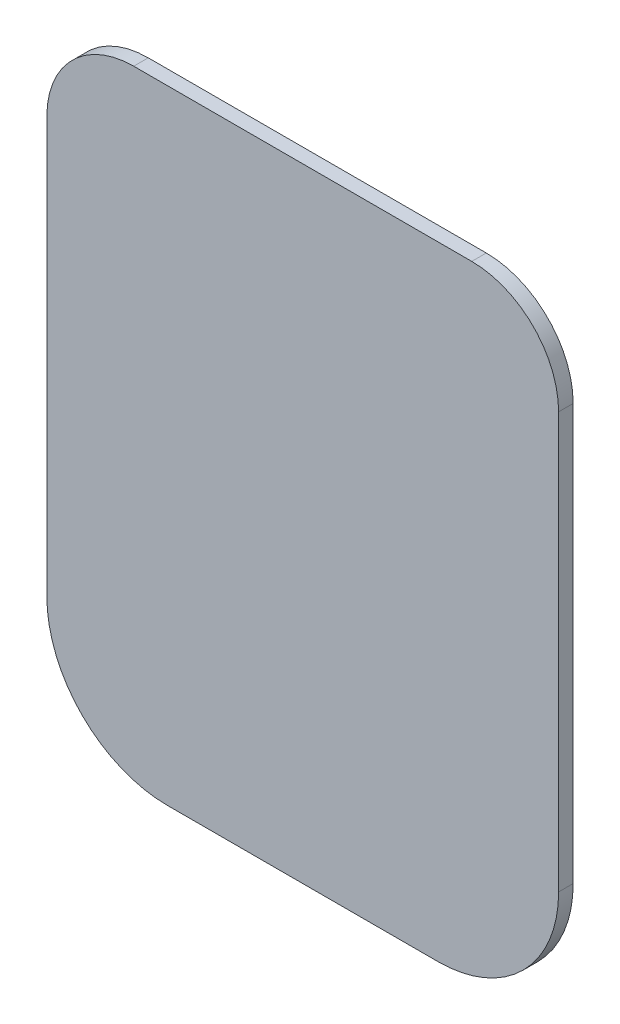
ISO-10303-21;
HEADER;
FILE_DESCRIPTION(('STEP AP214'),'2;1');
FILE_NAME('part.step','',(''),(''),'','','');
FILE_SCHEMA(('AUTOMOTIVE_DESIGN { 1 0 10303 214 1 1 1 1 }'));
ENDSEC;
DATA;
#1=APPLICATION_CONTEXT('core data for automotive mechanical design processes');
#2=APPLICATION_PROTOCOL_DEFINITION('international standard','automotive_design',2000,#1);
#3=PRODUCT_CONTEXT('',#1,'mechanical');
#4=PRODUCT('Part','Part','',(#3));
#5=PRODUCT_RELATED_PRODUCT_CATEGORY('part','',(#4));
#6=PRODUCT_DEFINITION_FORMATION('','',#4);
#7=PRODUCT_DEFINITION_CONTEXT('part definition',#1,'design');
#8=PRODUCT_DEFINITION('design','',#6,#7);
#9=PRODUCT_DEFINITION_SHAPE('','',#8);
#10=(LENGTH_UNIT() NAMED_UNIT(*) SI_UNIT(.MILLI.,.METRE.));
#11=(NAMED_UNIT(*) PLANE_ANGLE_UNIT() SI_UNIT($,.RADIAN.));
#12=(NAMED_UNIT(*) SI_UNIT($,.STERADIAN.) SOLID_ANGLE_UNIT());
#13=UNCERTAINTY_MEASURE_WITH_UNIT(LENGTH_MEASURE(1.E-05),#10,'distance_accuracy_value','');
#14=(GEOMETRIC_REPRESENTATION_CONTEXT(3) GLOBAL_UNCERTAINTY_ASSIGNED_CONTEXT((#13)) GLOBAL_UNIT_ASSIGNED_CONTEXT((#10,
#11,#12)) REPRESENTATION_CONTEXT('',''));
#15=CARTESIAN_POINT('',(0.,0.,0.));
#16=DIRECTION('',(0.,0.,1.));
#17=DIRECTION('',(1.,0.,0.));
#18=AXIS2_PLACEMENT_3D('',#15,#16,#17);
#19=CARTESIAN_POINT('',(40.,-56.5,4.29999999999997));
#20=DIRECTION('',(0.,0.,-1.));
#21=DIRECTION('',(-1.,0.,0.));
#22=AXIS2_PLACEMENT_3D('',#19,#20,#21);
#23=CYLINDRICAL_SURFACE('',#22,35.7);
#24=CARTESIAN_POINT('',(40.,-56.5,0.));
#25=DIRECTION('',(0.,0.,1.));
#26=DIRECTION('',(1.,0.,0.));
#27=AXIS2_PLACEMENT_3D('',#24,#25,#26);
#28=CIRCLE('',#27,35.7);
#29=CARTESIAN_POINT('',(40.,-92.2,0.));
#30=VERTEX_POINT('',#29);
#31=CARTESIAN_POINT('',(75.7,-56.5,0.));
#32=VERTEX_POINT('',#31);
#33=EDGE_CURVE('E136',#30,#32,#28,.T.);
#34=ORIENTED_EDGE('',*,*,#33,.T.);
#35=DIRECTION('',(0.,0.,-1.));
#36=VECTOR('',#35,1.);
#37=CARTESIAN_POINT('',(75.7,-56.5,4.29999999999997));
#38=LINE('',#37,#36);
#39=CARTESIAN_POINT('',(75.7,-56.5,4.29999999999997));
#40=VERTEX_POINT('',#39);
#41=EDGE_CURVE('E43',#40,#32,#38,.T.);
#42=ORIENTED_EDGE('',*,*,#41,.F.);
#43=CARTESIAN_POINT('',(40.,-56.5,4.29999999999997));
#44=DIRECTION('',(0.,0.,1.));
#45=DIRECTION('',(1.,0.,0.));
#46=AXIS2_PLACEMENT_3D('',#43,#44,#45);
#47=CIRCLE('',#46,35.7);
#48=CARTESIAN_POINT('',(40.,-92.2,4.29999999999997));
#49=VERTEX_POINT('',#48);
#50=EDGE_CURVE('E202',#49,#40,#47,.T.);
#51=ORIENTED_EDGE('',*,*,#50,.F.);
#52=DIRECTION('',(0.,0.,-1.));
#53=VECTOR('',#52,1.);
#54=CARTESIAN_POINT('',(40.,-92.2,4.29999999999997));
#55=LINE('',#54,#53);
#56=EDGE_CURVE('E11',#49,#30,#55,.T.);
#57=ORIENTED_EDGE('',*,*,#56,.T.);
#58=EDGE_LOOP('',(#34,#42,#51,#57));
#59=FACE_BOUND('',#58,.T.);
#60=ADVANCED_FACE('F34',(#59),#23,.T.);
#61=CARTESIAN_POINT('',(75.7,66.5,4.29999999999997));
#62=DIRECTION('',(-1.,0.,0.));
#63=DIRECTION('',(0.,-1.,0.));
#64=AXIS2_PLACEMENT_3D('',#61,#62,#63);
#65=PLANE('',#64);
#66=DIRECTION('',(0.,1.,0.));
#67=VECTOR('',#66,1.);
#68=CARTESIAN_POINT('',(75.7,66.5,0.));
#69=LINE('',#68,#67);
#70=CARTESIAN_POINT('',(75.7,66.5,0.));
#71=VERTEX_POINT('',#70);
#72=EDGE_CURVE('E139',#32,#71,#69,.T.);
#73=ORIENTED_EDGE('',*,*,#72,.T.);
#74=DIRECTION('',(0.,0.,-1.));
#75=VECTOR('',#74,1.);
#76=CARTESIAN_POINT('',(75.7,66.5,4.29999999999997));
#77=LINE('',#76,#75);
#78=CARTESIAN_POINT('',(75.7,66.5,4.29999999999997));
#79=VERTEX_POINT('',#78);
#80=EDGE_CURVE('E167',#79,#71,#77,.T.);
#81=ORIENTED_EDGE('',*,*,#80,.F.);
#82=DIRECTION('',(0.,1.,0.));
#83=VECTOR('',#82,1.);
#84=CARTESIAN_POINT('',(75.7,66.5,4.29999999999997));
#85=LINE('',#84,#83);
#86=EDGE_CURVE('E179',#40,#79,#85,.T.);
#87=ORIENTED_EDGE('',*,*,#86,.F.);
#88=ORIENTED_EDGE('',*,*,#41,.T.);
#89=EDGE_LOOP('',(#73,#81,#87,#88));
#90=FACE_BOUND('',#89,.T.);
#91=ADVANCED_FACE('F177',(#90),#65,.F.);
#92=CARTESIAN_POINT('',(50.,66.5,4.29999999999997));
#93=DIRECTION('',(0.,0.,-1.));
#94=DIRECTION('',(-1.,0.,0.));
#95=AXIS2_PLACEMENT_3D('',#92,#93,#94);
#96=CYLINDRICAL_SURFACE('',#95,25.7);
#97=CARTESIAN_POINT('',(50.,66.5,0.));
#98=DIRECTION('',(0.,0.,1.));
#99=DIRECTION('',(-1.,0.,0.));
#100=AXIS2_PLACEMENT_3D('',#97,#98,#99);
#101=CIRCLE('',#100,25.7);
#102=CARTESIAN_POINT('',(50.,92.2,0.));
#103=VERTEX_POINT('',#102);
#104=EDGE_CURVE('E142',#71,#103,#101,.T.);
#105=ORIENTED_EDGE('',*,*,#104,.T.);
#106=DIRECTION('',(0.,0.,-1.));
#107=VECTOR('',#106,1.);
#108=CARTESIAN_POINT('',(50.,92.2,4.29999999999997));
#109=LINE('',#108,#107);
#110=CARTESIAN_POINT('',(50.,92.2,4.29999999999997));
#111=VERTEX_POINT('',#110);
#112=EDGE_CURVE('E163',#111,#103,#109,.T.);
#113=ORIENTED_EDGE('',*,*,#112,.F.);
#114=CARTESIAN_POINT('',(50.,66.5,4.29999999999997));
#115=DIRECTION('',(0.,0.,1.));
#116=DIRECTION('',(-1.,0.,0.));
#117=AXIS2_PLACEMENT_3D('',#114,#115,#116);
#118=CIRCLE('',#117,25.7);
#119=EDGE_CURVE('E195',#79,#111,#118,.T.);
#120=ORIENTED_EDGE('',*,*,#119,.F.);
#121=ORIENTED_EDGE('',*,*,#80,.T.);
#122=EDGE_LOOP('',(#105,#113,#120,#121));
#123=FACE_BOUND('',#122,.T.);
#124=ADVANCED_FACE('F190',(#123),#96,.T.);
#125=CARTESIAN_POINT('',(-50.,92.2,4.29999999999997));
#126=DIRECTION('',(0.,-1.,0.));
#127=DIRECTION('',(0.,0.,-1.));
#128=AXIS2_PLACEMENT_3D('',#125,#126,#127);
#129=PLANE('',#128);
#130=DIRECTION('',(-1.,0.,0.));
#131=VECTOR('',#130,1.);
#132=CARTESIAN_POINT('',(-50.,92.2,0.));
#133=LINE('',#132,#131);
#134=CARTESIAN_POINT('',(-50.,92.2,0.));
#135=VERTEX_POINT('',#134);
#136=EDGE_CURVE('E145',#103,#135,#133,.T.);
#137=ORIENTED_EDGE('',*,*,#136,.T.);
#138=DIRECTION('',(0.,0.,-1.));
#139=VECTOR('',#138,1.);
#140=CARTESIAN_POINT('',(-50.,92.2,4.29999999999997));
#141=LINE('',#140,#139);
#142=CARTESIAN_POINT('',(-50.,92.2,4.29999999999997));
#143=VERTEX_POINT('',#142);
#144=EDGE_CURVE('E122',#143,#135,#141,.T.);
#145=ORIENTED_EDGE('',*,*,#144,.F.);
#146=DIRECTION('',(-1.,0.,0.));
#147=VECTOR('',#146,1.);
#148=CARTESIAN_POINT('',(-50.,92.2,4.29999999999997));
#149=LINE('',#148,#147);
#150=EDGE_CURVE('E111',#111,#143,#149,.T.);
#151=ORIENTED_EDGE('',*,*,#150,.F.);
#152=ORIENTED_EDGE('',*,*,#112,.T.);
#153=EDGE_LOOP('',(#137,#145,#151,#152));
#154=FACE_BOUND('',#153,.T.);
#155=ADVANCED_FACE('F193',(#154),#129,.F.);
#156=CARTESIAN_POINT('',(-50.,66.5,4.29999999999997));
#157=DIRECTION('',(0.,0.,-1.));
#158=DIRECTION('',(-1.,0.,0.));
#159=AXIS2_PLACEMENT_3D('',#156,#157,#158);
#160=CYLINDRICAL_SURFACE('',#159,25.7);
#161=CARTESIAN_POINT('',(-50.,66.5,0.));
#162=DIRECTION('',(0.,0.,1.));
#163=DIRECTION('',(-1.,0.,0.));
#164=AXIS2_PLACEMENT_3D('',#161,#162,#163);
#165=CIRCLE('',#164,25.7);
#166=CARTESIAN_POINT('',(-75.7,66.5,0.));
#167=VERTEX_POINT('',#166);
#168=EDGE_CURVE('E120',#135,#167,#165,.T.);
#169=ORIENTED_EDGE('',*,*,#168,.T.);
#170=DIRECTION('',(0.,0.,-1.));
#171=VECTOR('',#170,1.);
#172=CARTESIAN_POINT('',(-75.7,66.5,4.29999999999997));
#173=LINE('',#172,#171);
#174=CARTESIAN_POINT('',(-75.7,66.5,4.29999999999997));
#175=VERTEX_POINT('',#174);
#176=EDGE_CURVE('E117',#175,#167,#173,.T.);
#177=ORIENTED_EDGE('',*,*,#176,.F.);
#178=CARTESIAN_POINT('',(-50.,66.5,4.29999999999997));
#179=DIRECTION('',(0.,0.,1.));
#180=DIRECTION('',(-1.,0.,0.));
#181=AXIS2_PLACEMENT_3D('',#178,#179,#180);
#182=CIRCLE('',#181,25.7);
#183=EDGE_CURVE('E105',#143,#175,#182,.T.);
#184=ORIENTED_EDGE('',*,*,#183,.F.);
#185=ORIENTED_EDGE('',*,*,#144,.T.);
#186=EDGE_LOOP('',(#169,#177,#184,#185));
#187=FACE_BOUND('',#186,.T.);
#188=ADVANCED_FACE('F118',(#187),#160,.T.);
#189=CARTESIAN_POINT('',(-75.7,66.5,4.29999999999997));
#190=DIRECTION('',(1.,0.,0.));
#191=DIRECTION('',(0.,1.,0.));
#192=AXIS2_PLACEMENT_3D('',#189,#190,#191);
#193=PLANE('',#192);
#194=DIRECTION('',(0.,-1.,0.));
#195=VECTOR('',#194,1.);
#196=CARTESIAN_POINT('',(-75.7,66.5,0.));
#197=LINE('',#196,#195);
#198=CARTESIAN_POINT('',(-75.7,-56.5,0.));
#199=VERTEX_POINT('',#198);
#200=EDGE_CURVE('E81',#167,#199,#197,.T.);
#201=ORIENTED_EDGE('',*,*,#200,.T.);
#202=DIRECTION('',(0.,0.,-1.));
#203=VECTOR('',#202,1.);
#204=CARTESIAN_POINT('',(-75.7,-56.5,4.29999999999997));
#205=LINE('',#204,#203);
#206=CARTESIAN_POINT('',(-75.7,-56.5,4.29999999999997));
#207=VERTEX_POINT('',#206);
#208=EDGE_CURVE('E123',#207,#199,#205,.T.);
#209=ORIENTED_EDGE('',*,*,#208,.F.);
#210=DIRECTION('',(0.,-1.,0.));
#211=VECTOR('',#210,1.);
#212=CARTESIAN_POINT('',(-75.7,66.5,4.29999999999997));
#213=LINE('',#212,#211);
#214=EDGE_CURVE('E109',#175,#207,#213,.T.);
#215=ORIENTED_EDGE('',*,*,#214,.F.);
#216=ORIENTED_EDGE('',*,*,#176,.T.);
#217=EDGE_LOOP('',(#201,#209,#215,#216));
#218=FACE_BOUND('',#217,.T.);
#219=ADVANCED_FACE('F125',(#218),#193,.F.);
#220=CARTESIAN_POINT('',(-40.,-56.5,4.29999999999997));
#221=DIRECTION('',(0.,0.,-1.));
#222=DIRECTION('',(-1.,0.,0.));
#223=AXIS2_PLACEMENT_3D('',#220,#221,#222);
#224=CYLINDRICAL_SURFACE('',#223,35.7);
#225=CARTESIAN_POINT('',(-40.,-56.5,0.));
#226=DIRECTION('',(0.,0.,1.));
#227=DIRECTION('',(1.,0.,0.));
#228=AXIS2_PLACEMENT_3D('',#225,#226,#227);
#229=CIRCLE('',#228,35.7);
#230=CARTESIAN_POINT('',(-40.,-92.2,0.));
#231=VERTEX_POINT('',#230);
#232=EDGE_CURVE('E88',#199,#231,#229,.T.);
#233=ORIENTED_EDGE('',*,*,#232,.T.);
#234=DIRECTION('',(0.,0.,-1.));
#235=VECTOR('',#234,1.);
#236=CARTESIAN_POINT('',(-40.,-92.2,4.29999999999997));
#237=LINE('',#236,#235);
#238=CARTESIAN_POINT('',(-40.,-92.2,4.29999999999997));
#239=VERTEX_POINT('',#238);
#240=EDGE_CURVE('E132',#239,#231,#237,.T.);
#241=ORIENTED_EDGE('',*,*,#240,.F.);
#242=CARTESIAN_POINT('',(-40.,-56.5,4.29999999999997));
#243=DIRECTION('',(0.,0.,1.));
#244=DIRECTION('',(1.,0.,0.));
#245=AXIS2_PLACEMENT_3D('',#242,#243,#244);
#246=CIRCLE('',#245,35.7);
#247=EDGE_CURVE('E128',#207,#239,#246,.T.);
#248=ORIENTED_EDGE('',*,*,#247,.F.);
#249=ORIENTED_EDGE('',*,*,#208,.T.);
#250=EDGE_LOOP('',(#233,#241,#248,#249));
#251=FACE_BOUND('',#250,.T.);
#252=ADVANCED_FACE('F219',(#251),#224,.T.);
#253=CARTESIAN_POINT('',(-40.,-92.2,4.29999999999997));
#254=DIRECTION('',(0.,1.,0.));
#255=DIRECTION('',(-1.,0.,0.));
#256=AXIS2_PLACEMENT_3D('',#253,#254,#255);
#257=PLANE('',#256);
#258=DIRECTION('',(1.,0.,0.));
#259=VECTOR('',#258,1.);
#260=CARTESIAN_POINT('',(-40.,-92.2,0.));
#261=LINE('',#260,#259);
#262=EDGE_CURVE('E154',#231,#30,#261,.T.);
#263=ORIENTED_EDGE('',*,*,#262,.T.);
#264=ORIENTED_EDGE('',*,*,#56,.F.);
#265=DIRECTION('',(1.,0.,0.));
#266=VECTOR('',#265,1.);
#267=CARTESIAN_POINT('',(-0.499999999999976,-92.2,4.29999999999997));
#268=LINE('',#267,#266);
#269=EDGE_CURVE('E51',#239,#49,#268,.T.);
#270=ORIENTED_EDGE('',*,*,#269,.F.);
#271=ORIENTED_EDGE('',*,*,#240,.T.);
#272=EDGE_LOOP('',(#263,#264,#270,#271));
#273=FACE_BOUND('',#272,.T.);
#274=ADVANCED_FACE('F218',(#273),#257,.F.);
#275=CARTESIAN_POINT('',(40.,-56.5,4.29999999999997));
#276=DIRECTION('',(0.,0.,1.));
#277=DIRECTION('',(1.,0.,0.));
#278=AXIS2_PLACEMENT_3D('',#275,#276,#277);
#279=PLANE('',#278);
#280=ORIENTED_EDGE('',*,*,#269,.T.);
#281=ORIENTED_EDGE('',*,*,#50,.T.);
#282=ORIENTED_EDGE('',*,*,#86,.T.);
#283=ORIENTED_EDGE('',*,*,#119,.T.);
#284=ORIENTED_EDGE('',*,*,#150,.T.);
#285=ORIENTED_EDGE('',*,*,#183,.T.);
#286=ORIENTED_EDGE('',*,*,#214,.T.);
#287=ORIENTED_EDGE('',*,*,#247,.T.);
#288=EDGE_LOOP('',(#280,#281,#282,#283,#284,#285,#286,#287));
#289=FACE_BOUND('',#288,.T.);
#290=ADVANCED_FACE('F107',(#289),#279,.T.);
#291=CARTESIAN_POINT('',(40.,-56.5,0.));
#292=DIRECTION('',(0.,0.,1.));
#293=DIRECTION('',(1.,0.,0.));
#294=AXIS2_PLACEMENT_3D('',#291,#292,#293);
#295=PLANE('',#294);
#296=ORIENTED_EDGE('',*,*,#33,.F.);
#297=ORIENTED_EDGE('',*,*,#262,.F.);
#298=ORIENTED_EDGE('',*,*,#232,.F.);
#299=ORIENTED_EDGE('',*,*,#200,.F.);
#300=ORIENTED_EDGE('',*,*,#168,.F.);
#301=ORIENTED_EDGE('',*,*,#136,.F.);
#302=ORIENTED_EDGE('',*,*,#104,.F.);
#303=ORIENTED_EDGE('',*,*,#72,.F.);
#304=EDGE_LOOP('',(#296,#297,#298,#299,#300,#301,#302,#303));
#305=FACE_BOUND('',#304,.T.);
#306=ADVANCED_FACE('F185',(#305),#295,.F.);
#307=CLOSED_SHELL('',(#60,#91,#124,#155,#188,#219,#252,#274,#290,#306));
#308=MANIFOLD_SOLID_BREP('B2',#307);
#309=ADVANCED_BREP_SHAPE_REPRESENTATION('',(#18,#308),#14);
#310=SHAPE_DEFINITION_REPRESENTATION(#9,#309);
ENDSEC;
END-ISO-10303-21;
